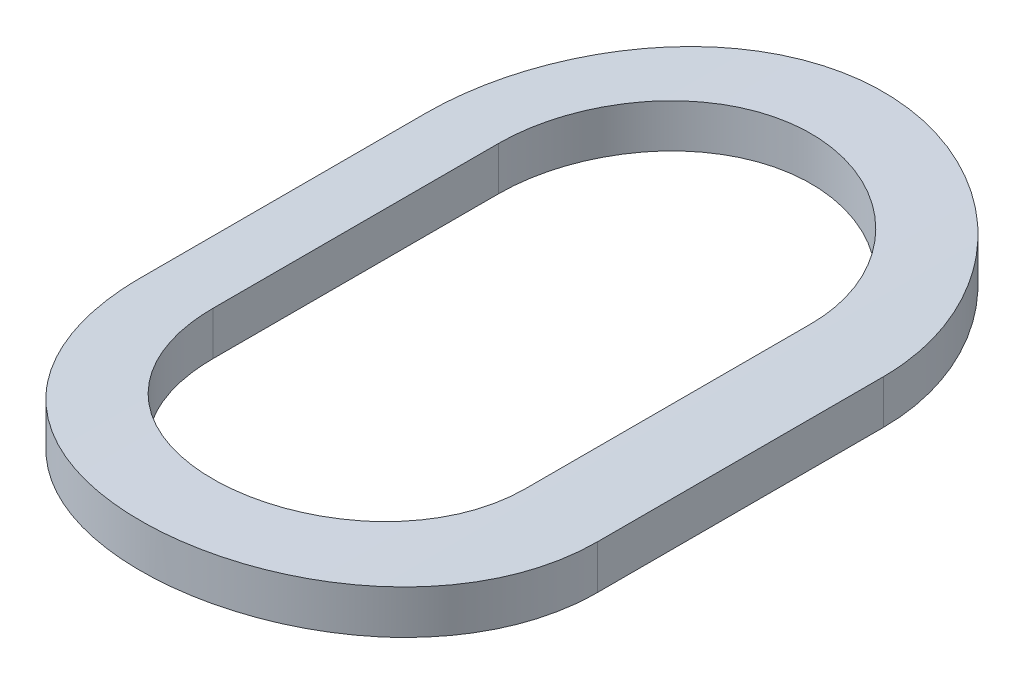
ISO-10303-21;
HEADER;
FILE_DESCRIPTION(('STEP AP214'),'2;1');
FILE_NAME('part.step','',(''),(''),'','','');
FILE_SCHEMA(('AUTOMOTIVE_DESIGN { 1 0 10303 214 1 1 1 1 }'));
ENDSEC;
DATA;
#1=APPLICATION_CONTEXT('core data for automotive mechanical design processes');
#2=APPLICATION_PROTOCOL_DEFINITION('international standard','automotive_design',2000,#1);
#3=PRODUCT_CONTEXT('',#1,'mechanical');
#4=PRODUCT('Part','Part','',(#3));
#5=PRODUCT_RELATED_PRODUCT_CATEGORY('part','',(#4));
#6=PRODUCT_DEFINITION_FORMATION('','',#4);
#7=PRODUCT_DEFINITION_CONTEXT('part definition',#1,'design');
#8=PRODUCT_DEFINITION('design','',#6,#7);
#9=PRODUCT_DEFINITION_SHAPE('','',#8);
#10=(LENGTH_UNIT() NAMED_UNIT(*) SI_UNIT(.MILLI.,.METRE.));
#11=(NAMED_UNIT(*) PLANE_ANGLE_UNIT() SI_UNIT($,.RADIAN.));
#12=(NAMED_UNIT(*) SI_UNIT($,.STERADIAN.) SOLID_ANGLE_UNIT());
#13=UNCERTAINTY_MEASURE_WITH_UNIT(LENGTH_MEASURE(1.E-05),#10,'distance_accuracy_value','');
#14=(GEOMETRIC_REPRESENTATION_CONTEXT(3) GLOBAL_UNCERTAINTY_ASSIGNED_CONTEXT((#13)) GLOBAL_UNIT_ASSIGNED_CONTEXT((#10,
#11,#12)) REPRESENTATION_CONTEXT('',''));
#15=CARTESIAN_POINT('',(0.,0.,0.));
#16=DIRECTION('',(0.,0.,1.));
#17=DIRECTION('',(1.,0.,0.));
#18=AXIS2_PLACEMENT_3D('',#15,#16,#17);
#19=CARTESIAN_POINT('',(-127.9233521598,-34.2539777719783,0.898559059800288));
#20=DIRECTION('',(0.,0.,1.));
#21=DIRECTION('',(1.,0.,0.));
#22=AXIS2_PLACEMENT_3D('',#19,#20,#21);
#23=CYLINDRICAL_SURFACE('',#22,4.);
#24=CARTESIAN_POINT('',(-127.491108186985,-30.2774007077225,3.32767141799325));
#25=CARTESIAN_POINT('',(-127.491087200258,-30.2774093032285,3.35191322019588));
#26=CARTESIAN_POINT('',(-127.493146244914,-30.2771792722829,3.37614724800924));
#27=CARTESIAN_POINT('',(-127.501267711605,-30.2763057606254,3.42390410653032));
#28=CARTESIAN_POINT('',(-127.507326225035,-30.2756626835923,3.44742760817381));
#29=CARTESIAN_POINT('',(-127.523293392494,-30.2740263559013,3.4931259713536));
#30=CARTESIAN_POINT('',(-127.533203439736,-30.2730329785417,3.51530034150927));
#31=CARTESIAN_POINT('',(-127.556581342248,-30.2708110127297,3.55766938751541));
#32=CARTESIAN_POINT('',(-127.570048813953,-30.269582449639,3.57786427647315));
#33=CARTESIAN_POINT('',(-127.600220287064,-30.2670221805073,3.61578591746701));
#34=CARTESIAN_POINT('',(-127.6169359698,-30.2656901129392,3.63350335222847));
#35=CARTESIAN_POINT('',(-127.653105985133,-30.2630762167541,3.66588911330933));
#36=CARTESIAN_POINT('',(-127.672560734073,-30.2617943958128,3.68055697524711));
#37=CARTESIAN_POINT('',(-127.713713980875,-30.2594218523872,3.70645791204082));
#38=CARTESIAN_POINT('',(-127.735417823731,-30.2583316025357,3.71768254141425));
#39=CARTESIAN_POINT('',(-127.780414746846,-30.256469127083,3.73632373673416));
#40=CARTESIAN_POINT('',(-127.803707686985,-30.2556968734843,3.74374063794231));
#41=CARTESIAN_POINT('',(-127.851126252775,-30.2545598909362,3.75452875151397));
#42=CARTESIAN_POINT('',(-127.875248269521,-30.2541935815582,3.75791565734689));
#43=CARTESIAN_POINT('',(-127.923721524934,-30.2539043752213,3.76059623696213));
#44=CARTESIAN_POINT('',(-127.948072762323,-30.2539814757901,3.75988993356705));
#45=CARTESIAN_POINT('',(-127.996205292226,-30.2545691293883,3.75441668768761));
#46=CARTESIAN_POINT('',(-128.019988542231,-30.2550778685343,3.74966673762009));
#47=CARTESIAN_POINT('',(-128.066418176187,-30.2564695592699,3.7362675551827));
#48=CARTESIAN_POINT('',(-128.089064549109,-30.2573525144896,3.7276182849868));
#49=CARTESIAN_POINT('',(-128.132631413093,-30.2593965328096,3.70664731910567));
#50=CARTESIAN_POINT('',(-128.153548245803,-30.2605581661113,3.69431808106823));
#51=CARTESIAN_POINT('',(-128.193021297876,-30.2630292276311,3.66634324034919));
#52=CARTESIAN_POINT('',(-128.211577539937,-30.2643386544278,3.65069766955999));
#53=CARTESIAN_POINT('',(-128.245901026669,-30.266966287132,3.61644108169204));
#54=CARTESIAN_POINT('',(-128.261653919007,-30.2682845042808,3.59781568194461));
#55=CARTESIAN_POINT('',(-128.289816419944,-30.270774951853,3.55817100557873));
#56=CARTESIAN_POINT('',(-128.302225018855,-30.2719471381304,3.53715100871695));
#57=CARTESIAN_POINT('',(-128.323347957904,-30.2740134538802,3.49329584496554));
#58=CARTESIAN_POINT('',(-128.33205911907,-30.2749073439047,3.47045913605634));
#59=CARTESIAN_POINT('',(-128.345502485206,-30.2763104155069,3.42366306664786));
#60=CARTESIAN_POINT('',(-128.350240700685,-30.2768201780969,3.3997054601005));
#61=CARTESIAN_POINT('',(-128.354711987777,-30.2773050457113,3.35963719078507));
#62=CARTESIAN_POINT('',(-128.355603730248,-30.2774034970037,3.34365045375636));
#63=CARTESIAN_POINT('',(-128.355596132613,-30.2774007077223,3.32767141799325));
#64=B_SPLINE_CURVE_WITH_KNOTS('',3,(#24,#25,#26,#27,#28,#29,#30,#31,#32,#33,#34,#35,#36,#37,#38,
#39,#40,#41,#42,#43,#44,#45,#46,#47,#48,#49,#50,#51,#52,#53,#54,#55,#56,#57,#58,#59,#60,#61,#62,
#63),.UNSPECIFIED.,.F.,.F.,(4,2,2,2,2,2,2,2,2,2,2,2,2,2,2,2,2,2,2,4),(0.,0.072625606291322,
0.145180341787481,0.217761346895157,0.290334529464338,0.363173700807066,0.436023955812666,
0.509051493289567,0.582072599757544,0.654808409475988,0.727543813640143,0.799975065682709,
0.87240702037229,0.944988460927711,1.01756920351632,1.09051146956909,1.1634757333035,
1.23650260356938,1.30941879404998,1.35735159725356),.UNSPECIFIED.);
#65=CARTESIAN_POINT('',(-127.491108186986,-30.2774007077225,3.32767141799325));
#66=VERTEX_POINT('',#65);
#67=CARTESIAN_POINT('',(-128.355596132613,-30.2774007077223,3.32767141799325));
#68=VERTEX_POINT('',#67);
#69=EDGE_CURVE('E173',#66,#68,#64,.T.);
#70=ORIENTED_EDGE('',*,*,#69,.T.);
#71=DIRECTION('',(0.,0.,-1.));
#72=VECTOR('',#71,1.);
#73=CARTESIAN_POINT('',(-128.355596132613,-30.2774007077224,2.53698122467284));
#74=LINE('',#73,#72);
#75=CARTESIAN_POINT('',(-128.355596132613,-30.2774007077223,2.53698122467284));
#76=VERTEX_POINT('',#75);
#77=EDGE_CURVE('E111',#76,#68,#74,.F.);
#78=ORIENTED_EDGE('',*,*,#77,.F.);
#79=CARTESIAN_POINT('',(-128.355596132613,-30.2774007077223,2.53698122467285));
#80=CARTESIAN_POINT('',(-128.355617122564,-30.2774093031018,2.51273949710905));
#81=CARTESIAN_POINT('',(-128.353558088976,-30.2771792736354,2.48850554374868));
#82=CARTESIAN_POINT('',(-128.34543664358,-30.2763057646065,2.44074868103932));
#83=CARTESIAN_POINT('',(-128.339378115823,-30.2756626861869,2.41722510497198));
#84=CARTESIAN_POINT('',(-128.323410759997,-30.2740263383596,2.37152618341243));
#85=CARTESIAN_POINT('',(-128.313500468394,-30.2730329358544,2.3493513541047));
#86=CARTESIAN_POINT('',(-128.290122387864,-30.2708109602008,2.30698238800606));
#87=CARTESIAN_POINT('',(-128.276655134346,-30.2695824224535,2.28678795374453));
#88=CARTESIAN_POINT('',(-128.246485774422,-30.2670223239816,2.24886886010778));
#89=CARTESIAN_POINT('',(-128.229772278111,-30.2656904107285,2.23115328612994));
#90=CARTESIAN_POINT('',(-128.193602531438,-30.2630765062061,2.19876680889327));
#91=CARTESIAN_POINT('',(-128.174145251963,-30.2617945338993,2.18409705315902));
#92=CARTESIAN_POINT('',(-128.132979806713,-30.2594212030672,2.15818776412632));
#93=CARTESIAN_POINT('',(-128.111265352569,-30.2583304011072,2.14695817765884));
#94=CARTESIAN_POINT('',(-128.06626175851,-30.256468301793,2.12832054764099));
#95=CARTESIAN_POINT('',(-128.042974493225,-30.2556966316194,2.12090804236424));
#96=CARTESIAN_POINT('',(-128.003525585014,-30.2547502618519,2.11193130537095));
#97=CARTESIAN_POINT('',(-127.98761455235,-30.2544619567995,2.10923732383196));
#98=CARTESIAN_POINT('',(-127.955588715831,-30.2540756112706,2.10563993703819));
#99=CARTESIAN_POINT('',(-127.939473908818,-30.2539775737453,2.10473655955755));
#100=CARTESIAN_POINT('',(-127.899148198746,-30.2539780695901,2.10473829122734));
#101=CARTESIAN_POINT('',(-127.874928590604,-30.2541997878823,2.10677707886366));
#102=CARTESIAN_POINT('',(-127.827162093491,-30.2550629316294,2.11487890770141));
#103=CARTESIAN_POINT('',(-127.803615946452,-30.2557048026716,2.12094622140064));
#104=CARTESIAN_POINT('',(-127.75789437027,-30.2573358336209,2.13692567576624));
#105=CARTESIAN_POINT('',(-127.735718096663,-30.2583247770098,2.14683541976901));
#106=CARTESIAN_POINT('',(-127.693347746542,-30.2605395731461,2.1702138832041));
#107=CARTESIAN_POINT('',(-127.6731533329,-30.2617653854947,2.18368199589106));
#108=CARTESIAN_POINT('',(-127.635232215171,-30.2643224002451,2.21385431836043));
#109=CARTESIAN_POINT('',(-127.617514873633,-30.2656539741726,2.23057026405765));
#110=CARTESIAN_POINT('',(-127.585130542844,-30.2682694573902,2.26674017806156));
#111=CARTESIAN_POINT('',(-127.570463816169,-30.2695533625694,2.2861943818173));
#112=CARTESIAN_POINT('',(-127.544561149847,-30.2719321143964,2.32735006486331));
#113=CARTESIAN_POINT('',(-127.533334696151,-30.273026434754,2.3490575406858));
#114=CARTESIAN_POINT('',(-127.514694899956,-30.2748965279096,2.39406039077544));
#115=CARTESIAN_POINT('',(-127.507279455028,-30.2756724762971,2.417354881479));
#116=CARTESIAN_POINT('',(-127.498299357738,-30.2766239966667,2.45682173519691));
#117=CARTESIAN_POINT('',(-127.495604627655,-30.2769138194439,2.47274340164556));
#118=CARTESIAN_POINT('',(-127.492009108139,-30.2773027678915,2.50476814628891));
#119=CARTESIAN_POINT('',(-127.491105867911,-30.2774021540767,2.52087094629864));
#120=CARTESIAN_POINT('',(-127.491108186985,-30.2774007077225,2.53698122467284));
#121=B_SPLINE_CURVE_WITH_KNOTS('',3,(#79,#80,#81,#82,#83,#84,#85,#86,#87,#88,#89,#90,#91,#92,
#93,#94,#95,#96,#97,#98,#99,#100,#101,#102,#103,#104,#105,#106,#107,#108,#109,#110,#111,#112,
#113,#114,#115,#116,#117,#118,#119,#120),.UNSPECIFIED.,.F.,.F.,(4,2,2,2,2,2,2,2,2,2,2,2,2,2,2,2,
2,2,2,2,4),(0.,0.0726253836740672,0.145180341790974,0.217762895225321,0.290334529446841,
0.363165547703881,0.436023955754691,0.509091078909636,0.582072600070054,0.63039788865521,
0.678723926810388,0.751276944723532,0.823907032711249,0.896491891356277,0.969064381374202,
1.04190415719806,1.11475019997868,1.18779533226153,1.26080012417626,1.30915708875174,
1.35744785425251),.UNSPECIFIED.);
#122=CARTESIAN_POINT('',(-127.491108186986,-30.2774007077225,2.53698122467284));
#123=VERTEX_POINT('',#122);
#124=EDGE_CURVE('E118',#76,#123,#121,.T.);
#125=ORIENTED_EDGE('',*,*,#124,.T.);
#126=DIRECTION('',(0.,0.,1.));
#127=VECTOR('',#126,1.);
#128=CARTESIAN_POINT('',(-127.491108186986,-30.2774007077225,3.32767141799325));
#129=LINE('',#128,#127);
#130=EDGE_CURVE('E115',#66,#123,#129,.F.);
#131=ORIENTED_EDGE('',*,*,#130,.F.);
#132=EDGE_LOOP('',(#70,#78,#125,#131));
#133=FACE_BOUND('',#132,.T.);
#134=DIRECTION('',(0.,0.,-1.));
#135=VECTOR('',#134,1.);
#136=CARTESIAN_POINT('',(-127.291108186986,-30.304260369576,2.53698113366286));
#137=LINE('',#136,#135);
#138=CARTESIAN_POINT('',(-127.291108186985,-30.304260369576,2.53698113366286));
#139=VERTEX_POINT('',#138);
#140=CARTESIAN_POINT('',(-127.291108186986,-30.304260369576,3.32767142524893));
#141=VERTEX_POINT('',#140);
#142=EDGE_CURVE('E98',#139,#141,#137,.F.);
#143=ORIENTED_EDGE('',*,*,#142,.F.);
#144=CARTESIAN_POINT('',(-128.555596132613,-30.3042603695757,2.5369812101615));
#145=CARTESIAN_POINT('',(-128.555627387224,-30.304278876853,2.50164800908936));
#146=CARTESIAN_POINT('',(-128.552636208905,-30.3037867472112,2.46632888846612));
#147=CARTESIAN_POINT('',(-128.540845617514,-30.3019193841848,2.39674107160949));
#148=CARTESIAN_POINT('',(-128.532053460947,-30.3005452541621,2.36247111893183));
#149=CARTESIAN_POINT('',(-128.508893430181,-30.2970509632074,2.29590205401699));
#150=CARTESIAN_POINT('',(-128.494524093114,-30.2949306065573,2.26360346143261));
#151=CARTESIAN_POINT('',(-128.460637675144,-30.2901894532235,2.20187575130305));
#152=CARTESIAN_POINT('',(-128.441120844078,-30.2875686808297,2.17244649458677));
#153=CARTESIAN_POINT('',(-128.397310962073,-30.2820950700764,2.11703750716805));
#154=CARTESIAN_POINT('',(-128.372982089938,-30.2792405915695,2.09108625843645));
#155=CARTESIAN_POINT('',(-128.320306751802,-30.2736351510171,2.0436081719019));
#156=CARTESIAN_POINT('',(-128.291958802139,-30.2708842276762,2.02208297521885));
#157=CARTESIAN_POINT('',(-128.231859534902,-30.2657780317078,1.98396261489406));
#158=CARTESIAN_POINT('',(-128.2000895606,-30.2634251284426,1.96739655203989));
#159=CARTESIAN_POINT('',(-128.134198211888,-30.2594028405985,1.93986450181564));
#160=CARTESIAN_POINT('',(-128.100079655864,-30.257732652884,1.92889193057306));
#161=CARTESIAN_POINT('',(-128.042040752499,-30.2556710021539,1.91551851078458));
#162=CARTESIAN_POINT('',(-128.018492887691,-30.2550391300323,1.91148153887147));
#163=CARTESIAN_POINT('',(-127.971084117245,-30.2541923034296,1.90609038184781));
#164=CARTESIAN_POINT('',(-127.947223208897,-30.2539773525595,1.90473621997278));
#165=CARTESIAN_POINT('',(-127.888077252383,-30.2539783917651,1.9047387767056));
#166=CARTESIAN_POINT('',(-127.852780200828,-30.2544493110809,1.90769960940602));
#167=CARTESIAN_POINT('',(-127.783172405955,-30.2562827320271,1.91946153892977));
#168=CARTESIAN_POINT('',(-127.748862719994,-30.2576461548607,1.92826867017951));
#169=CARTESIAN_POINT('',(-127.682250091331,-30.2611114507195,1.9514519843916));
#170=CARTESIAN_POINT('',(-127.649945514781,-30.2632127129732,1.96582356220252));
#171=CARTESIAN_POINT('',(-127.588211053602,-30.2679220586316,1.99971685602368));
#172=CARTESIAN_POINT('',(-127.558780798757,-30.2705300766358,2.01923790757242));
#173=CARTESIAN_POINT('',(-127.503372072292,-30.275988468317,2.06305480726007));
#174=CARTESIAN_POINT('',(-127.477421952997,-30.2788405549878,2.08738629677972));
#175=CARTESIAN_POINT('',(-127.429953718157,-30.2844525234804,2.14005890239298));
#176=CARTESIAN_POINT('',(-127.408436046607,-30.2872123960421,2.16840041968871));
#177=CARTESIAN_POINT('',(-127.370328442158,-30.2923445362424,2.22848424391947));
#178=CARTESIAN_POINT('',(-127.353767568818,-30.2947144827996,2.2602451764536));
#179=CARTESIAN_POINT('',(-127.326234149324,-30.2987729765585,2.32613670886304));
#180=CARTESIAN_POINT('',(-127.315258267424,-30.3004619303711,2.36026588038465));
#181=CARTESIAN_POINT('',(-127.301882817932,-30.3025469725133,2.41832662307034));
#182=CARTESIAN_POINT('',(-127.297846071149,-30.3031860821504,2.44188533451285));
#183=CARTESIAN_POINT('',(-127.292458430091,-30.3040442096806,2.48928615060252));
#184=CARTESIAN_POINT('',(-127.291104271006,-30.3042637382083,2.51312787519936));
#185=CARTESIAN_POINT('',(-127.291108186985,-30.304260369576,2.53698113366286));
#186=B_SPLINE_CURVE_WITH_KNOTS('',3,(#144,#145,#146,#147,#148,#149,#150,#151,#152,#153,#154,
#155,#156,#157,#158,#159,#160,#161,#162,#163,#164,#165,#166,#167,#168,#169,#170,#171,#172,#173,
#174,#175,#176,#177,#178,#179,#180,#181,#182,#183,#184,#185),.UNSPECIFIED.,.F.,.F.,(4,2,2,2,2,2,
2,2,2,2,2,2,2,2,2,2,2,2,2,2,4),(0.,0.10584873093635,0.211565304981317,0.317309626744838,
0.423048817048477,0.529606959470419,0.636204541237358,0.743415911855356,0.850500795226744,
0.922054105040372,0.993608034566653,1.0993452490884,1.20519177339648,1.31095088542595,
1.41669635751572,1.52325684616702,1.62982800371311,1.73701222616169,1.84413235534829,
1.91571776442044,1.98721599769587),.UNSPECIFIED.);
#187=CARTESIAN_POINT('',(-128.555596132613,-30.3042603695758,2.53698121741717));
#188=VERTEX_POINT('',#187);
#189=EDGE_CURVE('E21',#188,#139,#186,.T.);
#190=ORIENTED_EDGE('',*,*,#189,.F.);
#191=DIRECTION('',(0.,0.,1.));
#192=VECTOR('',#191,1.);
#193=CARTESIAN_POINT('',(-128.555596132613,-30.3042603695758,3.32767144701595));
#194=LINE('',#193,#192);
#195=CARTESIAN_POINT('',(-128.555596132613,-30.3042603695758,3.32767144701595));
#196=VERTEX_POINT('',#195);
#197=EDGE_CURVE('E85',#196,#188,#194,.F.);
#198=ORIENTED_EDGE('',*,*,#197,.F.);
#199=CARTESIAN_POINT('',(-127.291108186985,-30.304260369576,3.3276714325046));
#200=CARTESIAN_POINT('',(-127.29107693703,-30.3042788770945,3.36300472009901));
#201=CARTESIAN_POINT('',(-127.294068127674,-30.3037867449222,3.39832392705162));
#202=CARTESIAN_POINT('',(-127.305858742712,-30.3019193774029,3.46791173905647));
#203=CARTESIAN_POINT('',(-127.314650882257,-30.3005452497274,3.50218160546439));
#204=CARTESIAN_POINT('',(-127.33781065848,-30.2970509989242,3.56874991098185));
#205=CARTESIAN_POINT('',(-127.352179658213,-30.2949306934332,3.60104786589621));
#206=CARTESIAN_POINT('',(-127.386065829202,-30.2901895600897,3.66277568632196));
#207=CARTESIAN_POINT('',(-127.405582960091,-30.2875687361618,3.69220557431946));
#208=CARTESIAN_POINT('',(-127.449395817742,-30.2820947718338,3.74761816833567));
#209=CARTESIAN_POINT('',(-127.473727782055,-30.2792399723179,3.77357206312285));
#210=CARTESIAN_POINT('',(-127.526403495189,-30.2736345485693,3.82104913875097));
#211=CARTESIAN_POINT('',(-127.554747856826,-30.2708839403314,3.84257164154832));
#212=CARTESIAN_POINT('',(-127.614829672193,-30.2657794047655,3.88067994918478));
#213=CARTESIAN_POINT('',(-127.646584412438,-30.2634276707934,3.89723881901847));
#214=CARTESIAN_POINT('',(-127.712466070859,-30.25940459693,3.92477599341702));
#215=CARTESIAN_POINT('',(-127.746592713534,-30.2577331781726,3.93575494487466));
#216=CARTESIAN_POINT('',(-127.815950500319,-30.2552706736928,3.95173330408055));
#217=CARTESIAN_POINT('',(-127.851170123094,-30.2544723948262,3.95678159606476));
#218=CARTESIAN_POINT('',(-127.92196581868,-30.2538214254185,3.96090725367253));
#219=CARTESIAN_POINT('',(-127.95754187804,-30.2539686993305,3.95998484375629));
#220=CARTESIAN_POINT('',(-128.027704865255,-30.2551865542934,3.95223342707574));
#221=CARTESIAN_POINT('',(-128.062297785524,-30.2562488876718,3.94545718089831));
#222=CARTESIAN_POINT('',(-128.129849092161,-30.2591682960876,3.92627342373138));
#223=CARTESIAN_POINT('',(-128.162807442808,-30.2610253884849,3.91386578973602));
#224=CARTESIAN_POINT('',(-128.226313208968,-30.2653398033245,3.8837179619301));
#225=CARTESIAN_POINT('',(-128.256849964925,-30.2677996035833,3.86595568316047));
#226=CARTESIAN_POINT('',(-128.314528173285,-30.2730455572148,3.8256195694519));
#227=CARTESIAN_POINT('',(-128.341669508062,-30.2758317218872,3.80304556789564));
#228=CARTESIAN_POINT('',(-128.392095765048,-30.2814557389835,3.75343697641385));
#229=CARTESIAN_POINT('',(-128.415335898095,-30.2842938247062,3.72635686829276));
#230=CARTESIAN_POINT('',(-128.456955927425,-30.2896734240352,3.66864807448392));
#231=CARTESIAN_POINT('',(-128.475334426147,-30.292214852245,3.63801837203502));
#232=CARTESIAN_POINT('',(-128.50671684419,-30.2967137751545,3.57402642323281));
#233=CARTESIAN_POINT('',(-128.519712634031,-30.2986703853747,3.54066013421064));
#234=CARTESIAN_POINT('',(-128.539884318288,-30.3017639618722,3.47220366073159));
#235=CARTESIAN_POINT('',(-128.547068925715,-30.3029021549599,3.43711614110765));
#236=CARTESIAN_POINT('',(-128.552696444625,-30.3037971684178,3.38941609530861));
#237=CARTESIAN_POINT('',(-128.5537842964,-30.3039707212086,3.37708194544345));
#238=CARTESIAN_POINT('',(-128.555233186943,-30.3042022005102,3.35239079813081));
#239=CARTESIAN_POINT('',(-128.55559544791,-30.304260321455,3.34003387425499));
#240=CARTESIAN_POINT('',(-128.555596132613,-30.3042603695757,3.32767144701595));
#241=B_SPLINE_CURVE_WITH_KNOTS('',3,(#199,#200,#201,#202,#203,#204,#205,#206,#207,#208,#209,
#210,#211,#212,#213,#214,#215,#216,#217,#218,#219,#220,#221,#222,#223,#224,#225,#226,#227,#228,
#229,#230,#231,#232,#233,#234,#235,#236,#237,#238,#239,#240),.UNSPECIFIED.,.F.,.F.,(4,2,2,2,2,2,
2,2,2,2,2,2,2,2,2,2,2,2,2,2,4),(0.,0.105848989046621,0.211565304974137,0.3173074755882,
0.42304881709969,0.529618532219078,0.636204541383858,0.743358880401687,0.85050079393498,
0.956753238060125,1.06300168779628,1.16830239507935,1.27360540254609,1.37934881120727,
1.48509588207984,1.59198440577072,1.69890362310571,1.80598373634126,1.91290299954314,
1.95003645147299,1.98710730238441),.UNSPECIFIED.);
#242=EDGE_CURVE('E99',#141,#196,#241,.T.);
#243=ORIENTED_EDGE('',*,*,#242,.F.);
#244=EDGE_LOOP('',(#143,#190,#198,#243));
#245=FACE_BOUND('',#244,.T.);
#246=ADVANCED_FACE('F17',(#133,#245),#23,.T.);
#247=CARTESIAN_POINT('',(-127.291108186986,-36.1825523620957,2.53698113366286));
#248=DIRECTION('',(1.,0.,0.));
#249=DIRECTION('',(0.,0.,-1.));
#250=AXIS2_PLACEMENT_3D('',#247,#248,#249);
#251=PLANE('',#250);
#252=ORIENTED_EDGE('',*,*,#142,.T.);
#253=DIRECTION('',(0.,-1.,0.));
#254=VECTOR('',#253,1.);
#255=CARTESIAN_POINT('',(-127.291108186985,-36.1825523620957,3.3276714325046));
#256=LINE('',#255,#254);
#257=CARTESIAN_POINT('',(-127.291108186985,-30.4258362439207,3.32767142524893));
#258=VERTEX_POINT('',#257);
#259=EDGE_CURVE('E168',#258,#141,#256,.F.);
#260=ORIENTED_EDGE('',*,*,#259,.F.);
#261=DIRECTION('',(0.,0.,1.));
#262=VECTOR('',#261,1.);
#263=CARTESIAN_POINT('',(-127.291108186986,-30.4258362439206,0.898559059800288));
#264=LINE('',#263,#262);
#265=CARTESIAN_POINT('',(-127.291108186985,-30.4258362439207,2.53698113366286));
#266=VERTEX_POINT('',#265);
#267=EDGE_CURVE('E106',#258,#266,#264,.F.);
#268=ORIENTED_EDGE('',*,*,#267,.T.);
#269=DIRECTION('',(0.,-1.,0.));
#270=VECTOR('',#269,1.);
#271=CARTESIAN_POINT('',(-127.291108186985,-36.1825523620957,2.53698113366286));
#272=LINE('',#271,#270);
#273=EDGE_CURVE('E93',#139,#266,#272,.T.);
#274=ORIENTED_EDGE('',*,*,#273,.F.);
#275=EDGE_LOOP('',(#252,#260,#268,#274));
#276=FACE_BOUND('',#275,.T.);
#277=ADVANCED_FACE('F105',(#276),#251,.T.);
#278=CARTESIAN_POINT('',(-127.923352159799,-36.1825523620957,2.53698122467284));
#279=DIRECTION('',(0.,-1.,0.));
#280=DIRECTION('',(0.,0.,-1.));
#281=AXIS2_PLACEMENT_3D('',#278,#279,#280);
#282=CYLINDRICAL_SURFACE('',#281,0.632243972813892);
#283=CARTESIAN_POINT('',(-127.291108186985,-30.4258362439207,2.53698113366286));
#284=CARTESIAN_POINT('',(-127.29107687203,-30.4258553372712,2.50166273210405));
#285=CARTESIAN_POINT('',(-127.294065627132,-30.425347987169,2.46635873298627));
#286=CARTESIAN_POINT('',(-127.305845769865,-30.4234230482252,2.39680238197964));
#287=CARTESIAN_POINT('',(-127.314629717331,-30.4220066265596,2.36254874051771));
#288=CARTESIAN_POINT('',(-127.337766718273,-30.4184050685595,2.29601216278382));
#289=CARTESIAN_POINT('',(-127.352121155065,-30.4162197412957,2.26372971832455));
#290=CARTESIAN_POINT('',(-127.385971199564,-30.4113334996578,2.20203105736461));
#291=CARTESIAN_POINT('',(-127.405466619181,-30.4086326041474,2.17261473605656));
#292=CARTESIAN_POINT('',(-127.449238847324,-30.4029901587619,2.11721243947844));
#293=CARTESIAN_POINT('',(-127.473553722625,-30.4000468096386,2.09125672038016));
#294=CARTESIAN_POINT('',(-127.526201707093,-30.3942664314077,2.04376625136695));
#295=CARTESIAN_POINT('',(-127.554536297595,-30.3914294419849,2.02223313845339));
#296=CARTESIAN_POINT('',(-127.614622019028,-30.3861618519328,1.98408647266399));
#297=CARTESIAN_POINT('',(-127.646392950447,-30.3837338378389,1.96750375384778));
#298=CARTESIAN_POINT('',(-127.712291927276,-30.379582461092,1.93993960257545));
#299=CARTESIAN_POINT('',(-127.746417145187,-30.3778582697949,1.92895157942559));
#300=CARTESIAN_POINT('',(-127.804495859424,-30.375728338768,1.91554928079844));
#301=CARTESIAN_POINT('',(-127.82807618238,-30.3750750783192,1.91150082608977));
#302=CARTESIAN_POINT('',(-127.875551675841,-30.3741995773534,1.90609428412391));
#303=CARTESIAN_POINT('',(-127.899446848804,-30.3739773402025,1.90473621787661));
#304=CARTESIAN_POINT('',(-127.958612023302,-30.3739784088391,1.90473877696257));
#305=CARTESIAN_POINT('',(-127.993893942774,-30.3744634768632,1.90769711564049));
#306=CARTESIAN_POINT('',(-128.063471205737,-30.3763519998967,1.91944867364607));
#307=CARTESIAN_POINT('',(-128.097765495174,-30.3777564007213,1.92824790224727));
#308=CARTESIAN_POINT('',(-128.164347128755,-30.3813259386316,1.95140901379385));
#309=CARTESIAN_POINT('',(-128.196636152727,-30.3834904285853,1.96576616584134));
#310=CARTESIAN_POINT('',(-128.258342358772,-30.3883418932907,1.99962410631115));
#311=CARTESIAN_POINT('',(-128.287759897164,-30.3910288030919,2.01912425542977));
#312=CARTESIAN_POINT('',(-128.343161459837,-30.3966544846913,2.06290397983291));
#313=CARTESIAN_POINT('',(-128.369115448681,-30.3995951359185,2.08722132425168));
#314=CARTESIAN_POINT('',(-128.416594959663,-30.4053825704983,2.13986608713058));
#315=CARTESIAN_POINT('',(-128.43812002976,-30.4082293442444,2.16819391442584));
#316=CARTESIAN_POINT('',(-128.4762534154,-30.4135254042076,2.22826395623589));
#317=CARTESIAN_POINT('',(-128.49283083649,-30.4159721513683,2.2600260044408));
#318=CARTESIAN_POINT('',(-128.520396068249,-30.4201631991098,2.32592535378808));
#319=CARTESIAN_POINT('',(-128.531387247163,-30.4219079228457,2.36006120948431));
#320=CARTESIAN_POINT('',(-128.54479113382,-30.4240635002151,2.41816114477347));
#321=CARTESIAN_POINT('',(-128.548839162202,-30.4247247182119,2.44175163468148));
#322=CARTESIAN_POINT('',(-128.554242041728,-30.4256125839174,2.48921820118615));
#323=CARTESIAN_POINT('',(-128.555600116494,-30.4258397517774,2.51309390140961));
#324=CARTESIAN_POINT('',(-128.555596132613,-30.4258362439204,2.5369812101615));
#325=B_SPLINE_CURVE_WITH_KNOTS('',3,(#283,#284,#285,#286,#287,#288,#289,#290,#291,#292,#293,
#294,#295,#296,#297,#298,#299,#300,#301,#302,#303,#304,#305,#306,#307,#308,#309,#310,#311,#312,
#313,#314,#315,#316,#317,#318,#319,#320,#321,#322,#323,#324),.UNSPECIFIED.,.F.,.F.,(4,2,2,2,2,2,
2,2,2,2,2,2,2,2,2,2,2,2,2,2,4),(0.,0.105803750682361,0.211471928732498,0.317166364113115,
0.422856933044903,0.529418198510919,0.636018836193061,0.743270221080642,0.850394967082618,
0.922050899715297,0.993707391923684,1.09939930845641,1.20520013272278,1.31091109677199,
1.41660892653704,1.52317084867862,1.62974364174851,1.73696861313821,1.84412885591571,
1.91581484100148,1.98741486599118),.UNSPECIFIED.);
#326=CARTESIAN_POINT('',(-128.555596132613,-30.4258362439204,2.53698121741717));
#327=VERTEX_POINT('',#326);
#328=EDGE_CURVE('E150',#266,#327,#325,.T.);
#329=ORIENTED_EDGE('',*,*,#328,.T.);
#330=DIRECTION('',(0.,1.,0.));
#331=VECTOR('',#330,1.);
#332=CARTESIAN_POINT('',(-128.555596132613,-36.1825523620957,2.5369812101615));
#333=LINE('',#332,#331);
#334=EDGE_CURVE('E95',#188,#327,#333,.F.);
#335=ORIENTED_EDGE('',*,*,#334,.F.);
#336=ORIENTED_EDGE('',*,*,#189,.T.);
#337=ORIENTED_EDGE('',*,*,#273,.T.);
#338=EDGE_LOOP('',(#329,#335,#336,#337));
#339=FACE_BOUND('',#338,.T.);
#340=ADVANCED_FACE('F91',(#339),#282,.T.);
#341=CARTESIAN_POINT('',(-128.555596132613,-36.1825523620957,3.32767144701595));
#342=DIRECTION('',(-1.,0.,0.));
#343=DIRECTION('',(0.,0.,1.));
#344=AXIS2_PLACEMENT_3D('',#341,#342,#343);
#345=PLANE('',#344);
#346=ORIENTED_EDGE('',*,*,#197,.T.);
#347=ORIENTED_EDGE('',*,*,#334,.T.);
#348=DIRECTION('',(0.,0.,1.));
#349=VECTOR('',#348,1.);
#350=CARTESIAN_POINT('',(-128.555596132613,-30.4258362439204,0.898559059800288));
#351=LINE('',#350,#349);
#352=CARTESIAN_POINT('',(-128.555596132613,-30.4258362439204,3.32767144701595));
#353=VERTEX_POINT('',#352);
#354=EDGE_CURVE('E149',#327,#353,#351,.T.);
#355=ORIENTED_EDGE('',*,*,#354,.T.);
#356=DIRECTION('',(0.,-1.,0.));
#357=VECTOR('',#356,1.);
#358=CARTESIAN_POINT('',(-128.555596132613,-36.1825523620957,3.32767144701595));
#359=LINE('',#358,#357);
#360=EDGE_CURVE('E114',#196,#353,#359,.T.);
#361=ORIENTED_EDGE('',*,*,#360,.F.);
#362=EDGE_LOOP('',(#346,#347,#355,#361));
#363=FACE_BOUND('',#362,.T.);
#364=ADVANCED_FACE('F161',(#363),#345,.T.);
#365=CARTESIAN_POINT('',(-127.923352159799,-36.1825523620957,3.32767141799325));
#366=DIRECTION('',(0.,-1.,0.));
#367=DIRECTION('',(0.,0.,-1.));
#368=AXIS2_PLACEMENT_3D('',#365,#366,#367);
#369=CYLINDRICAL_SURFACE('',#368,0.63224397281389);
#370=ORIENTED_EDGE('',*,*,#360,.T.);
#371=CARTESIAN_POINT('',(-128.555596132613,-30.4258362439204,3.32767144701595));
#372=CARTESIAN_POINT('',(-128.555627446382,-30.4258553380892,3.36298993240042));
#373=CARTESIAN_POINT('',(-128.552638682874,-30.4253479860267,3.3982940154674));
#374=CARTESIAN_POINT('',(-128.540858524227,-30.4234230436711,3.46785036275541));
#375=CARTESIAN_POINT('',(-128.532074596736,-30.4220066248651,3.50210392131587));
#376=CARTESIAN_POINT('',(-128.508937854556,-30.4184051088153,3.56863974841097));
#377=CARTESIAN_POINT('',(-128.494583756003,-30.4162198343696,3.60092156049277));
#378=CARTESIAN_POINT('',(-128.460733963134,-30.4113336138359,3.66262033420913));
#379=CARTESIAN_POINT('',(-128.441238248895,-30.4086326657499,3.6920372847427));
#380=CARTESIAN_POINT('',(-128.397463064243,-30.4029898575305,3.74744317807995));
#381=CARTESIAN_POINT('',(-128.373145111878,-30.4000461786285,3.77340153662791));
#382=CARTESIAN_POINT('',(-128.320496759478,-30.3942658174923,3.82089100412816));
#383=CARTESIAN_POINT('',(-128.292165745941,-30.3914291517021,3.84242143491885));
#384=CARTESIAN_POINT('',(-128.232097433943,-30.3861632699046,3.88055607380868));
#385=CARTESIAN_POINT('',(-128.200341703971,-30.383736459422,3.89713160995988));
#386=CARTESIAN_POINT('',(-128.134452411851,-30.3795842738066,3.92470088115295));
#387=CARTESIAN_POINT('',(-128.100319133782,-30.3778588150417,3.93569528175182));
#388=CARTESIAN_POINT('',(-128.030961252363,-30.3753164891915,3.95169719866785));
#389=CARTESIAN_POINT('',(-127.995748920492,-30.3744917473888,3.95675663213774));
#390=CARTESIAN_POINT('',(-127.924965281575,-30.3738167338891,3.96090640963923));
#391=CARTESIAN_POINT('',(-127.889393989427,-30.3739664219127,3.95999700040131));
#392=CARTESIAN_POINT('',(-127.819258806539,-30.3752171911045,3.95227528913885));
#393=CARTESIAN_POINT('',(-127.784688563162,-30.376309241681,3.94551901543848));
#394=CARTESIAN_POINT('',(-127.717179328405,-30.3793119546057,3.92638356118796));
#395=CARTESIAN_POINT('',(-127.684240374747,-30.3812226358739,3.9140042506793));
#396=CARTESIAN_POINT('',(-127.620760641659,-30.3856633721133,3.88391782576044));
#397=CARTESIAN_POINT('',(-127.590231100592,-30.3881961262514,3.86618741415374));
#398=CARTESIAN_POINT('',(-127.532560628193,-30.3935992742922,3.82591977572968));
#399=CARTESIAN_POINT('',(-127.50541983167,-30.3964696816185,3.80338235777918));
#400=CARTESIAN_POINT('',(-127.454968438095,-30.4022677454514,3.75383285692361));
#401=CARTESIAN_POINT('',(-127.431705379439,-30.4051956809042,3.72677238324648));
#402=CARTESIAN_POINT('',(-127.390035882015,-30.410747725104,3.66909762575037));
#403=CARTESIAN_POINT('',(-127.371630832993,-30.4133717467892,3.63848232859014));
#404=CARTESIAN_POINT('',(-127.340191069044,-30.4180193375722,3.57450884539503));
#405=CARTESIAN_POINT('',(-127.327165028717,-30.420041935309,3.54114633208875));
#406=CARTESIAN_POINT('',(-127.306933612368,-30.4232422208001,3.47268952065723));
#407=CARTESIAN_POINT('',(-127.299719528978,-30.4244211721927,3.43759789707487));
#408=CARTESIAN_POINT('',(-127.294045321095,-30.4253521721865,3.38981258884453));
#409=CARTESIAN_POINT('',(-127.292943429496,-30.425533540373,3.37739961854267));
#410=CARTESIAN_POINT('',(-127.291475824222,-30.4257754520869,3.35255004712349));
#411=CARTESIAN_POINT('',(-127.29110887247,-30.4258361988114,3.34011352113394));
#412=CARTESIAN_POINT('',(-127.291108186985,-30.4258362439207,3.3276714325046));
#413=B_SPLINE_CURVE_WITH_KNOTS('',3,(#371,#372,#373,#374,#375,#376,#377,#378,#379,#380,#381,
#382,#383,#384,#385,#386,#387,#388,#389,#390,#391,#392,#393,#394,#395,#396,#397,#398,#399,#400,
#401,#402,#403,#404,#405,#406,#407,#408,#409,#410,#411,#412),.UNSPECIFIED.,.F.,.F.,(4,2,2,2,2,2,
2,2,2,2,2,2,2,2,2,2,2,2,2,2,4),(0.,0.105804000768797,0.211471928108137,0.317164225229959,
0.4228569318802,0.529429728088785,0.636018834374695,0.743213292156194,0.850394963867262,
0.956631883182559,1.06286441107329,1.16809008479601,1.27331819059717,1.37901120601074,
1.48470842470676,1.59161882935367,1.69855978514669,1.80567253485947,1.91262451019972,
1.94999712415136,1.98730672722252),.UNSPECIFIED.);
#414=EDGE_CURVE('E142',#353,#258,#413,.T.);
#415=ORIENTED_EDGE('',*,*,#414,.T.);
#416=ORIENTED_EDGE('',*,*,#259,.T.);
#417=ORIENTED_EDGE('',*,*,#242,.T.);
#418=EDGE_LOOP('',(#370,#415,#416,#417));
#419=FACE_BOUND('',#418,.T.);
#420=ADVANCED_FACE('F155',(#419),#369,.T.);
#421=CARTESIAN_POINT('',(-128.355596132613,-36.1825523620957,2.53698122467284));
#422=DIRECTION('',(1.,0.,0.));
#423=DIRECTION('',(0.,0.,-1.));
#424=AXIS2_PLACEMENT_3D('',#421,#422,#423);
#425=PLANE('',#424);
#426=ORIENTED_EDGE('',*,*,#77,.T.);
#427=DIRECTION('',(0.,-1.,0.));
#428=VECTOR('',#427,1.);
#429=CARTESIAN_POINT('',(-128.355596132613,-36.1825523620957,3.32767141799325));
#430=LINE('',#429,#428);
#431=CARTESIAN_POINT('',(-128.355596132613,-30.398129597067,3.32767141799325));
#432=VERTEX_POINT('',#431);
#433=EDGE_CURVE('E211',#68,#432,#430,.T.);
#434=ORIENTED_EDGE('',*,*,#433,.T.);
#435=DIRECTION('',(0.,0.,1.));
#436=VECTOR('',#435,1.);
#437=CARTESIAN_POINT('',(-128.355596132613,-30.398129597067,0.898559059800288));
#438=LINE('',#437,#436);
#439=CARTESIAN_POINT('',(-128.355596132613,-30.398129597067,2.53698122467285));
#440=VERTEX_POINT('',#439);
#441=EDGE_CURVE('E148',#432,#440,#438,.F.);
#442=ORIENTED_EDGE('',*,*,#441,.T.);
#443=DIRECTION('',(0.,-1.,0.));
#444=VECTOR('',#443,1.);
#445=CARTESIAN_POINT('',(-128.355596132613,-36.1825523620957,2.53698122467285));
#446=LINE('',#445,#444);
#447=EDGE_CURVE('E113',#440,#76,#446,.F.);
#448=ORIENTED_EDGE('',*,*,#447,.T.);
#449=EDGE_LOOP('',(#426,#434,#442,#448));
#450=FACE_BOUND('',#449,.T.);
#451=ADVANCED_FACE('F160',(#450),#425,.T.);
#452=CARTESIAN_POINT('',(-127.923352159799,-36.1825523620957,2.53698122467284));
#453=DIRECTION('',(0.,-1.,0.));
#454=DIRECTION('',(0.,0.,-1.));
#455=AXIS2_PLACEMENT_3D('',#452,#453,#454);
#456=CYLINDRICAL_SURFACE('',#455,0.432243972813884);
#457=ORIENTED_EDGE('',*,*,#124,.F.);
#458=ORIENTED_EDGE('',*,*,#447,.F.);
#459=CARTESIAN_POINT('',(-128.355596132613,-30.398129597067,2.53698122467285));
#460=CARTESIAN_POINT('',(-128.355617143593,-30.398138461391,2.51274420708846));
#461=CARTESIAN_POINT('',(-128.353558885066,-30.3979013183326,2.4885150652369));
#462=CARTESIAN_POINT('',(-128.345440780718,-30.3970008343412,2.44076821724572));
#463=CARTESIAN_POINT('',(-128.339384878891,-30.3963379134896,2.41724983377763));
#464=CARTESIAN_POINT('',(-128.323424891983,-30.3946511351841,2.3715612494115));
#465=CARTESIAN_POINT('',(-128.31351936902,-30.3936271428787,2.3493915558487));
#466=CARTESIAN_POINT('',(-128.290152931766,-30.3913367859817,2.30703181305385));
#467=CARTESIAN_POINT('',(-128.276692532474,-30.3900704565049,2.28684147765063));
#468=CARTESIAN_POINT('',(-128.246535176061,-30.3874312779715,2.24892442616004));
#469=CARTESIAN_POINT('',(-128.22982610312,-30.3860580420778,2.23120737278267));
#470=CARTESIAN_POINT('',(-128.193664975431,-30.3833629484714,2.19881684750773));
#471=CARTESIAN_POINT('',(-128.174211892445,-30.3820411102564,2.18414452164773));
#472=CARTESIAN_POINT('',(-128.133050680001,-30.379593623306,2.15822684617406));
#473=CARTESIAN_POINT('',(-128.111335913307,-30.3784685795403,2.14699198710738));
#474=CARTESIAN_POINT('',(-128.066329892415,-30.3765478765735,2.12834420100714));
#475=CARTESIAN_POINT('',(-128.043040515697,-30.3757518328769,2.12092681007654));
#476=CARTESIAN_POINT('',(-128.003578933929,-30.3747752200699,2.11194096821675));
#477=CARTESIAN_POINT('',(-127.987657563821,-30.3744776019595,2.10924337989968));
#478=CARTESIAN_POINT('',(-127.955610498405,-30.3740787743024,2.10564116160226));
#479=CARTESIAN_POINT('',(-127.939484800006,-30.3739775677314,2.10473655878585));
#480=CARTESIAN_POINT('',(-127.899153055173,-30.3739780783505,2.10473829147482));
#481=CARTESIAN_POINT('',(-127.874938331296,-30.3742065617847,2.1067762711374));
#482=CARTESIAN_POINT('',(-127.827181691776,-30.3750960459599,2.11487473790831));
#483=CARTESIAN_POINT('',(-127.803640517019,-30.3757575052113,2.12093948936337));
#484=CARTESIAN_POINT('',(-127.75792895546,-30.3774383313766,2.13691173741436));
#485=CARTESIAN_POINT('',(-127.735757708889,-30.3784574710701,2.14681679483119));
#486=CARTESIAN_POINT('',(-127.693396466799,-30.3807399867704,2.17018377605915));
#487=CARTESIAN_POINT('',(-127.673206138948,-30.3820033217033,2.1836451018411));
#488=CARTESIAN_POINT('',(-127.6352871577,-30.3846390968795,2.21380547637653));
#489=CARTESIAN_POINT('',(-127.617568431698,-30.3860119441671,2.23051697114464));
#490=CARTESIAN_POINT('',(-127.585180218677,-30.3887087594235,2.26667819046397));
#491=CARTESIAN_POINT('',(-127.570510996228,-30.3900327231432,2.28612815235366));
#492=CARTESIAN_POINT('',(-127.544600013857,-30.3924861836676,2.32727958395474));
#493=CARTESIAN_POINT('',(-127.53336829998,-30.3936151063601,2.34898740913523));
#494=CARTESIAN_POINT('',(-127.514718393283,-30.3955445537707,2.39399272063598));
#495=CARTESIAN_POINT('',(-127.507298088692,-30.3963452602923,2.41728931854874));
#496=CARTESIAN_POINT('',(-127.498308964035,-30.3973275070233,2.45676871319686));
#497=CARTESIAN_POINT('',(-127.49561066283,-30.3976267939652,2.47270058191505));
#498=CARTESIAN_POINT('',(-127.492010325027,-30.398028454328,2.50474639365466));
#499=CARTESIAN_POINT('',(-127.491105848784,-30.3981310951858,2.52086005937121));
#500=CARTESIAN_POINT('',(-127.491108186985,-30.3981295970672,2.53698122467285));
#501=B_SPLINE_CURVE_WITH_KNOTS('',3,(#459,#460,#461,#462,#463,#464,#465,#466,#467,#468,#469,
#470,#471,#472,#473,#474,#475,#476,#477,#478,#479,#480,#481,#482,#483,#484,#485,#486,#487,#488,
#489,#490,#491,#492,#493,#494,#495,#496,#497,#498,#499,#500),.UNSPECIFIED.,.F.,.F.,(4,2,2,2,2,2,
2,2,2,2,2,2,2,2,2,2,2,2,2,2,4),(0.,0.0726110703568851,0.145150610932129,0.217717272017487,
0.290273426057535,0.363105554309556,0.435965047098448,0.509044726041058,0.582038755124309,
0.630396664646988,0.678755306791647,0.75129370260513,0.823909039280895,0.896478329517945,
0.969035424117954,1.0418760389733,1.11472297069651,1.18778080670379,1.26079812010337,
1.30918729504397,1.35751061429024),.UNSPECIFIED.);
#502=CARTESIAN_POINT('',(-127.491108186986,-30.3981295970671,2.53698122467284));
#503=VERTEX_POINT('',#502);
#504=EDGE_CURVE('E125',#440,#503,#501,.T.);
#505=ORIENTED_EDGE('',*,*,#504,.T.);
#506=DIRECTION('',(0.,1.,0.));
#507=VECTOR('',#506,1.);
#508=CARTESIAN_POINT('',(-127.491108186986,-36.1825523620957,2.53698122467284));
#509=LINE('',#508,#507);
#510=EDGE_CURVE('E117',#123,#503,#509,.F.);
#511=ORIENTED_EDGE('',*,*,#510,.F.);
#512=EDGE_LOOP('',(#457,#458,#505,#511));
#513=FACE_BOUND('',#512,.T.);
#514=ADVANCED_FACE('F177',(#513),#456,.F.);
#515=CARTESIAN_POINT('',(-127.491108186986,-36.1825523620957,3.32767141799325));
#516=DIRECTION('',(-1.,0.,0.));
#517=DIRECTION('',(0.,0.,1.));
#518=AXIS2_PLACEMENT_3D('',#515,#516,#517);
#519=PLANE('',#518);
#520=ORIENTED_EDGE('',*,*,#130,.T.);
#521=ORIENTED_EDGE('',*,*,#510,.T.);
#522=DIRECTION('',(0.,0.,1.));
#523=VECTOR('',#522,1.);
#524=CARTESIAN_POINT('',(-127.491108186986,-30.3981295970671,0.898559059800288));
#525=LINE('',#524,#523);
#526=CARTESIAN_POINT('',(-127.491108186985,-30.3981295970672,3.32767141799325));
#527=VERTEX_POINT('',#526);
#528=EDGE_CURVE('E31',#503,#527,#525,.T.);
#529=ORIENTED_EDGE('',*,*,#528,.T.);
#530=DIRECTION('',(0.,-1.,0.));
#531=VECTOR('',#530,1.);
#532=CARTESIAN_POINT('',(-127.491108186985,-36.1825523620957,3.32767141799325));
#533=LINE('',#532,#531);
#534=EDGE_CURVE('E39',#527,#66,#533,.F.);
#535=ORIENTED_EDGE('',*,*,#534,.T.);
#536=EDGE_LOOP('',(#520,#521,#529,#535));
#537=FACE_BOUND('',#536,.T.);
#538=ADVANCED_FACE('F180',(#537),#519,.T.);
#539=CARTESIAN_POINT('',(-127.923352159799,-36.1825523620957,3.32767141799325));
#540=DIRECTION('',(0.,-1.,0.));
#541=DIRECTION('',(0.,0.,-1.));
#542=AXIS2_PLACEMENT_3D('',#539,#540,#541);
#543=CYLINDRICAL_SURFACE('',#542,0.43224397281389);
#544=ORIENTED_EDGE('',*,*,#433,.F.);
#545=ORIENTED_EDGE('',*,*,#69,.F.);
#546=ORIENTED_EDGE('',*,*,#534,.F.);
#547=CARTESIAN_POINT('',(-127.491108186985,-30.3981295970672,3.32767141799325));
#548=CARTESIAN_POINT('',(-127.491087179227,-30.3981384615208,3.35190850934036));
#549=CARTESIAN_POINT('',(-127.493145448671,-30.3979013169548,3.37613772477171));
#550=CARTESIAN_POINT('',(-127.501263574024,-30.3970008302843,3.42388456862373));
#551=CARTESIAN_POINT('',(-127.507319461675,-30.3963379108452,3.44740287854182));
#552=CARTESIAN_POINT('',(-127.523279261025,-30.3946511532195,3.49309090672826));
#553=CARTESIAN_POINT('',(-127.533184540396,-30.3936271867665,3.51526014243439));
#554=CARTESIAN_POINT('',(-127.556550800144,-30.3913368399867,3.55761996488445));
#555=CARTESIAN_POINT('',(-127.570011416884,-30.3900704844551,3.57781075369328));
#556=CARTESIAN_POINT('',(-127.600170882108,-30.3874311302914,3.61573034802936));
#557=CARTESIAN_POINT('',(-127.61688213747,-30.3860577355526,3.63344925934197));
#558=CARTESIAN_POINT('',(-127.65304353314,-30.3833626505135,3.66583906984802));
#559=CARTESIAN_POINT('',(-127.672494089871,-30.3820409681135,3.68050950477712));
#560=CARTESIAN_POINT('',(-127.713643118505,-30.379594292289,3.70641883407466));
#561=CARTESIAN_POINT('',(-127.735347284612,-30.3784698173995,3.71764873812838));
#562=CARTESIAN_POINT('',(-127.78034663698,-30.3765487271556,3.73630008616413));
#563=CARTESIAN_POINT('',(-127.803641680531,-30.375752082438,3.74372187124871));
#564=CARTESIAN_POINT('',(-127.85106012114,-30.3745791444223,3.75451743019879));
#565=CARTESIAN_POINT('',(-127.87517967778,-30.3742011197578,3.75790788154325));
#566=CARTESIAN_POINT('',(-127.92364880287,-30.3739021121989,3.7605961863004));
#567=CARTESIAN_POINT('',(-127.947998369627,-30.373981125943,3.75989406981323));
#568=CARTESIAN_POINT('',(-127.99612168111,-30.3745858992713,3.75443048586943));
#569=CARTESIAN_POINT('',(-128.019897503633,-30.3751096722969,3.74968706894108));
#570=CARTESIAN_POINT('',(-128.066313368716,-30.3765428469412,3.73630371854214));
#571=CARTESIAN_POINT('',(-128.08895339942,-30.3774522525849,3.72766374440163));
#572=CARTESIAN_POINT('',(-128.132512029708,-30.3795579222314,3.70671280188925));
#573=CARTESIAN_POINT('',(-128.153426757755,-30.3807548090076,3.69439384940979));
#574=CARTESIAN_POINT('',(-128.192897793404,-30.3833012247143,3.6664410363904));
#575=CARTESIAN_POINT('',(-128.211454117863,-30.3846507525536,3.65080719954728));
#576=CARTESIAN_POINT('',(-128.245786204912,-30.3873597422383,3.61656930665673));
#577=CARTESIAN_POINT('',(-128.261546703346,-30.388719218817,3.59794994201551));
#578=CARTESIAN_POINT('',(-128.289725492938,-30.3912880781797,3.55831555791997));
#579=CARTESIAN_POINT('',(-128.302142777793,-30.3924974157132,3.5372998198642));
#580=CARTESIAN_POINT('',(-128.323284080445,-30.394629726593,3.49345028437396));
#581=CARTESIAN_POINT('',(-128.332004824897,-30.3955524459421,3.47061489677678));
#582=CARTESIAN_POINT('',(-128.345467131714,-30.3970012852221,3.42381902389744));
#583=CARTESIAN_POINT('',(-128.350214701326,-30.397528003764,3.39986029518929));
#584=CARTESIAN_POINT('',(-128.354706303331,-30.3980303038748,3.3597396771102));
#585=CARTESIAN_POINT('',(-128.355603806294,-30.398132501503,3.3437017105731));
#586=CARTESIAN_POINT('',(-128.355596132613,-30.398129597067,3.32767141799325));
#587=B_SPLINE_CURVE_WITH_KNOTS('',3,(#547,#548,#549,#550,#551,#552,#553,#554,#555,#556,#557,
#558,#559,#560,#561,#562,#563,#564,#565,#566,#567,#568,#569,#570,#571,#572,#573,#574,#575,#576,
#577,#578,#579,#580,#581,#582,#583,#584,#585,#586),.UNSPECIFIED.,.F.,.F.,(4,2,2,2,2,2,2,2,2,2,2,
2,2,2,2,2,2,2,2,4),(0.,0.0726112903627205,0.145150610928532,0.217715728023075,0.290273426076023,
0.363113694111983,0.435965047158847,0.509005172732467,0.582038754780204,0.654769136547274,
0.727498983395617,0.799905674146988,0.872313120653314,0.944878861818142,1.01744408425655,
1.09039404692339,1.16336594294014,1.23640232239222,1.30932807382706,1.35741434342201),.UNSPECIFIED.);
#588=EDGE_CURVE('E11',#527,#432,#587,.T.);
#589=ORIENTED_EDGE('',*,*,#588,.T.);
#590=EDGE_LOOP('',(#544,#545,#546,#589));
#591=FACE_BOUND('',#590,.T.);
#592=ADVANCED_FACE('F131',(#591),#543,.F.);
#593=CARTESIAN_POINT('',(-127.9233521598,-34.2539777719783,0.898559059800288));
#594=DIRECTION('',(0.,0.,1.));
#595=DIRECTION('',(1.,0.,0.));
#596=AXIS2_PLACEMENT_3D('',#593,#594,#595);
#597=CYLINDRICAL_SURFACE('',#596,3.87999999999999);
#598=ORIENTED_EDGE('',*,*,#528,.F.);
#599=ORIENTED_EDGE('',*,*,#504,.F.);
#600=ORIENTED_EDGE('',*,*,#441,.F.);
#601=ORIENTED_EDGE('',*,*,#588,.F.);
#602=EDGE_LOOP('',(#598,#599,#600,#601));
#603=FACE_BOUND('',#602,.T.);
#604=ORIENTED_EDGE('',*,*,#354,.F.);
#605=ORIENTED_EDGE('',*,*,#328,.F.);
#606=ORIENTED_EDGE('',*,*,#267,.F.);
#607=ORIENTED_EDGE('',*,*,#414,.F.);
#608=EDGE_LOOP('',(#604,#605,#606,#607));
#609=FACE_BOUND('',#608,.T.);
#610=ADVANCED_FACE('F134',(#603,#609),#597,.F.);
#611=CLOSED_SHELL('',(#246,#277,#340,#364,#420,#451,#514,#538,#592,#610));
#612=MANIFOLD_SOLID_BREP('B1',#611);
#613=ADVANCED_BREP_SHAPE_REPRESENTATION('',(#18,#612),#14);
#614=SHAPE_DEFINITION_REPRESENTATION(#9,#613);
ENDSEC;
END-ISO-10303-21;
